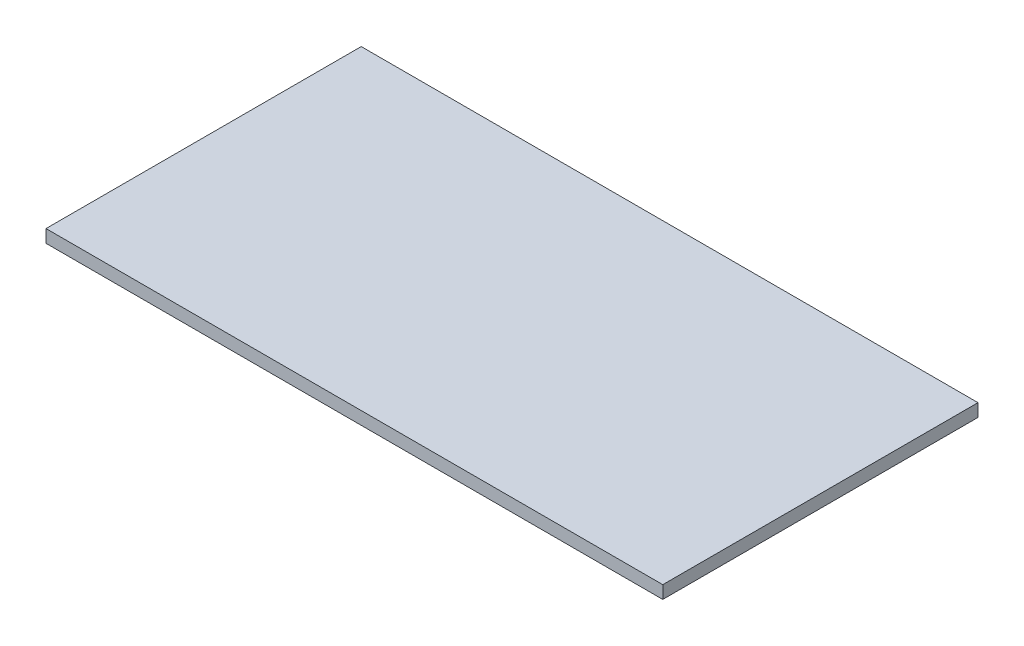
ISO-10303-21;
HEADER;
FILE_DESCRIPTION(('STEP AP214'),'2;1');
FILE_NAME('part.step','',(''),(''),'','','');
FILE_SCHEMA(('AUTOMOTIVE_DESIGN { 1 0 10303 214 1 1 1 1 }'));
ENDSEC;
DATA;
#1=APPLICATION_CONTEXT('core data for automotive mechanical design processes');
#2=APPLICATION_PROTOCOL_DEFINITION('international standard','automotive_design',2000,#1);
#3=PRODUCT_CONTEXT('',#1,'mechanical');
#4=PRODUCT('Part','Part','',(#3));
#5=PRODUCT_RELATED_PRODUCT_CATEGORY('part','',(#4));
#6=PRODUCT_DEFINITION_FORMATION('','',#4);
#7=PRODUCT_DEFINITION_CONTEXT('part definition',#1,'design');
#8=PRODUCT_DEFINITION('design','',#6,#7);
#9=PRODUCT_DEFINITION_SHAPE('','',#8);
#10=(LENGTH_UNIT() NAMED_UNIT(*) SI_UNIT(.MILLI.,.METRE.));
#11=(NAMED_UNIT(*) PLANE_ANGLE_UNIT() SI_UNIT($,.RADIAN.));
#12=(NAMED_UNIT(*) SI_UNIT($,.STERADIAN.) SOLID_ANGLE_UNIT());
#13=UNCERTAINTY_MEASURE_WITH_UNIT(LENGTH_MEASURE(1.E-05),#10,'distance_accuracy_value','');
#14=(GEOMETRIC_REPRESENTATION_CONTEXT(3) GLOBAL_UNCERTAINTY_ASSIGNED_CONTEXT((#13)) GLOBAL_UNIT_ASSIGNED_CONTEXT((#10,
#11,#12)) REPRESENTATION_CONTEXT('',''));
#15=CARTESIAN_POINT('',(0.,0.,0.));
#16=DIRECTION('',(0.,0.,1.));
#17=DIRECTION('',(1.,0.,0.));
#18=AXIS2_PLACEMENT_3D('',#15,#16,#17);
#19=CARTESIAN_POINT('',(286.54375,-5.953125,-292.89375));
#20=DIRECTION('',(1.,0.,0.));
#21=DIRECTION('',(0.,0.,-1.));
#22=AXIS2_PLACEMENT_3D('',#19,#20,#21);
#23=PLANE('',#22);
#24=DIRECTION('',(0.,1.,0.));
#25=VECTOR('',#24,1.);
#26=CARTESIAN_POINT('',(286.54375,-5.953125,0.));
#27=LINE('',#26,#25);
#28=CARTESIAN_POINT('',(286.54375,-5.953125,0.));
#29=VERTEX_POINT('',#28);
#30=CARTESIAN_POINT('',(286.54375,5.953125,0.));
#31=VERTEX_POINT('',#30);
#32=EDGE_CURVE('E109',#29,#31,#27,.T.);
#33=ORIENTED_EDGE('',*,*,#32,.F.);
#34=DIRECTION('',(0.,0.,1.));
#35=VECTOR('',#34,1.);
#36=CARTESIAN_POINT('',(286.54375,-5.953125,-292.89375));
#37=LINE('',#36,#35);
#38=CARTESIAN_POINT('',(286.54375,-5.953125,-292.89375));
#39=VERTEX_POINT('',#38);
#40=EDGE_CURVE('E11',#39,#29,#37,.T.);
#41=ORIENTED_EDGE('',*,*,#40,.F.);
#42=DIRECTION('',(0.,1.,0.));
#43=VECTOR('',#42,1.);
#44=CARTESIAN_POINT('',(286.54375,-5.953125,-292.89375));
#45=LINE('',#44,#43);
#46=CARTESIAN_POINT('',(286.54375,5.953125,-292.89375));
#47=VERTEX_POINT('',#46);
#48=EDGE_CURVE('E101',#39,#47,#45,.T.);
#49=ORIENTED_EDGE('',*,*,#48,.T.);
#50=DIRECTION('',(0.,0.,1.));
#51=VECTOR('',#50,1.);
#52=CARTESIAN_POINT('',(286.54375,5.953125,-292.89375));
#53=LINE('',#52,#51);
#54=EDGE_CURVE('E42',#47,#31,#53,.T.);
#55=ORIENTED_EDGE('',*,*,#54,.T.);
#56=EDGE_LOOP('',(#33,#41,#49,#55));
#57=FACE_BOUND('',#56,.T.);
#58=ADVANCED_FACE('F39',(#57),#23,.T.);
#59=CARTESIAN_POINT('',(-286.54375,-5.953125,-292.89375));
#60=DIRECTION('',(0.,-1.,0.));
#61=DIRECTION('',(0.,0.,-1.));
#62=AXIS2_PLACEMENT_3D('',#59,#60,#61);
#63=PLANE('',#62);
#64=DIRECTION('',(1.,0.,0.));
#65=VECTOR('',#64,1.);
#66=CARTESIAN_POINT('',(-286.54375,-5.953125,0.));
#67=LINE('',#66,#65);
#68=CARTESIAN_POINT('',(-286.54375,-5.953125,0.));
#69=VERTEX_POINT('',#68);
#70=EDGE_CURVE('E104',#69,#29,#67,.T.);
#71=ORIENTED_EDGE('',*,*,#70,.F.);
#72=DIRECTION('',(0.,0.,1.));
#73=VECTOR('',#72,1.);
#74=CARTESIAN_POINT('',(-286.54375,-5.953125,-292.89375));
#75=LINE('',#74,#73);
#76=CARTESIAN_POINT('',(-286.54375,-5.953125,-292.89375));
#77=VERTEX_POINT('',#76);
#78=EDGE_CURVE('E49',#77,#69,#75,.T.);
#79=ORIENTED_EDGE('',*,*,#78,.F.);
#80=DIRECTION('',(1.,0.,0.));
#81=VECTOR('',#80,1.);
#82=CARTESIAN_POINT('',(-286.54375,-5.953125,-292.89375));
#83=LINE('',#82,#81);
#84=EDGE_CURVE('E96',#77,#39,#83,.T.);
#85=ORIENTED_EDGE('',*,*,#84,.T.);
#86=ORIENTED_EDGE('',*,*,#40,.T.);
#87=EDGE_LOOP('',(#71,#79,#85,#86));
#88=FACE_BOUND('',#87,.T.);
#89=ADVANCED_FACE('F125',(#88),#63,.T.);
#90=CARTESIAN_POINT('',(-286.54375,-5.953125,-292.89375));
#91=DIRECTION('',(-1.,0.,0.));
#92=DIRECTION('',(0.,0.,1.));
#93=AXIS2_PLACEMENT_3D('',#90,#91,#92);
#94=PLANE('',#93);
#95=DIRECTION('',(0.,-1.,0.));
#96=VECTOR('',#95,1.);
#97=CARTESIAN_POINT('',(-286.54375,-5.953125,0.));
#98=LINE('',#97,#96);
#99=CARTESIAN_POINT('',(-286.54375,5.953125,0.));
#100=VERTEX_POINT('',#99);
#101=EDGE_CURVE('E90',#100,#69,#98,.T.);
#102=ORIENTED_EDGE('',*,*,#101,.F.);
#103=DIRECTION('',(0.,0.,1.));
#104=VECTOR('',#103,1.);
#105=CARTESIAN_POINT('',(-286.54375,5.953125,-292.89375));
#106=LINE('',#105,#104);
#107=CARTESIAN_POINT('',(-286.54375,5.953125,-292.89375));
#108=VERTEX_POINT('',#107);
#109=EDGE_CURVE('E85',#108,#100,#106,.T.);
#110=ORIENTED_EDGE('',*,*,#109,.F.);
#111=DIRECTION('',(0.,-1.,0.));
#112=VECTOR('',#111,1.);
#113=CARTESIAN_POINT('',(-286.54375,-5.953125,-292.89375));
#114=LINE('',#113,#112);
#115=EDGE_CURVE('E88',#108,#77,#114,.T.);
#116=ORIENTED_EDGE('',*,*,#115,.T.);
#117=ORIENTED_EDGE('',*,*,#78,.T.);
#118=EDGE_LOOP('',(#102,#110,#116,#117));
#119=FACE_BOUND('',#118,.T.);
#120=ADVANCED_FACE('F87',(#119),#94,.T.);
#121=CARTESIAN_POINT('',(-286.54375,5.953125,-292.89375));
#122=DIRECTION('',(0.,1.,0.));
#123=DIRECTION('',(0.,0.,1.));
#124=AXIS2_PLACEMENT_3D('',#121,#122,#123);
#125=PLANE('',#124);
#126=DIRECTION('',(-1.,0.,0.));
#127=VECTOR('',#126,1.);
#128=CARTESIAN_POINT('',(-286.54375,5.953125,0.));
#129=LINE('',#128,#127);
#130=EDGE_CURVE('E113',#31,#100,#129,.T.);
#131=ORIENTED_EDGE('',*,*,#130,.F.);
#132=ORIENTED_EDGE('',*,*,#54,.F.);
#133=DIRECTION('',(-1.,0.,0.));
#134=VECTOR('',#133,1.);
#135=CARTESIAN_POINT('',(-286.54375,5.953125,-292.89375));
#136=LINE('',#135,#134);
#137=EDGE_CURVE('E95',#47,#108,#136,.T.);
#138=ORIENTED_EDGE('',*,*,#137,.T.);
#139=ORIENTED_EDGE('',*,*,#109,.T.);
#140=EDGE_LOOP('',(#131,#132,#138,#139));
#141=FACE_BOUND('',#140,.T.);
#142=ADVANCED_FACE('F99',(#141),#125,.T.);
#143=CARTESIAN_POINT('',(0.,0.,-292.89375));
#144=DIRECTION('',(0.,0.,-1.));
#145=DIRECTION('',(-1.,0.,0.));
#146=AXIS2_PLACEMENT_3D('',#143,#144,#145);
#147=PLANE('',#146);
#148=ORIENTED_EDGE('',*,*,#48,.F.);
#149=ORIENTED_EDGE('',*,*,#84,.F.);
#150=ORIENTED_EDGE('',*,*,#115,.F.);
#151=ORIENTED_EDGE('',*,*,#137,.F.);
#152=EDGE_LOOP('',(#148,#149,#150,#151));
#153=FACE_BOUND('',#152,.T.);
#154=ADVANCED_FACE('F94',(#153),#147,.T.);
#155=CARTESIAN_POINT('',(0.,0.,0.));
#156=DIRECTION('',(0.,0.,-1.));
#157=DIRECTION('',(-1.,0.,0.));
#158=AXIS2_PLACEMENT_3D('',#155,#156,#157);
#159=PLANE('',#158);
#160=ORIENTED_EDGE('',*,*,#32,.T.);
#161=ORIENTED_EDGE('',*,*,#130,.T.);
#162=ORIENTED_EDGE('',*,*,#101,.T.);
#163=ORIENTED_EDGE('',*,*,#70,.T.);
#164=EDGE_LOOP('',(#160,#161,#162,#163));
#165=FACE_BOUND('',#164,.T.);
#166=ADVANCED_FACE('F124',(#165),#159,.F.);
#167=CLOSED_SHELL('',(#58,#89,#120,#142,#154,#166));
#168=MANIFOLD_SOLID_BREP('B2',#167);
#169=ADVANCED_BREP_SHAPE_REPRESENTATION('',(#18,#168),#14);
#170=SHAPE_DEFINITION_REPRESENTATION(#9,#169);
ENDSEC;
END-ISO-10303-21;
